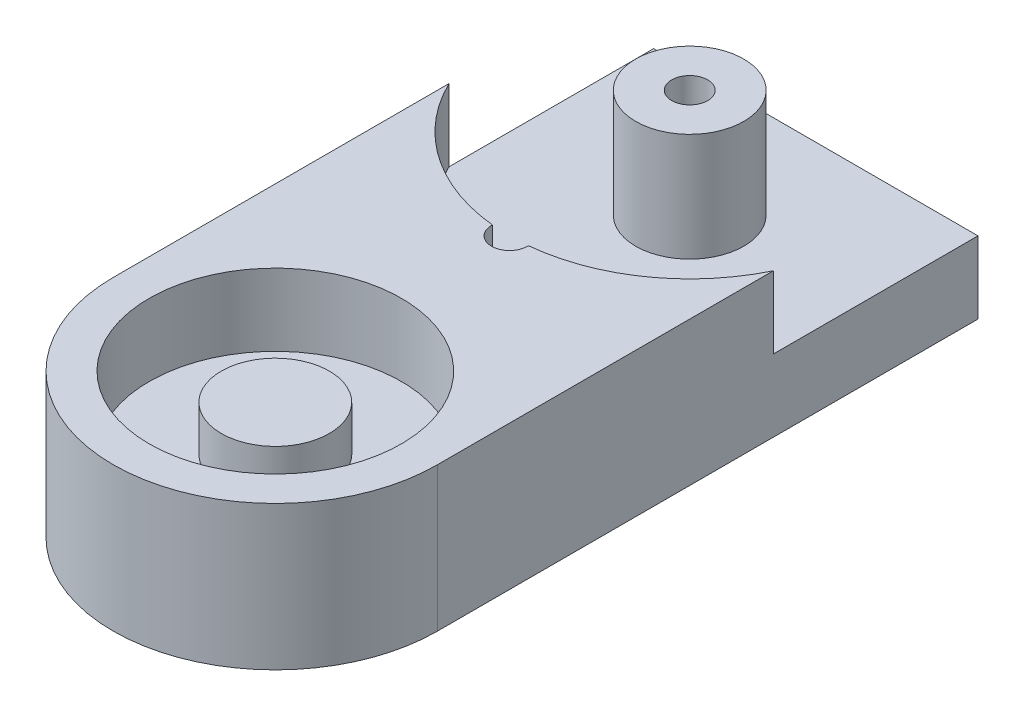
ISO-10303-21;
HEADER;
FILE_DESCRIPTION(('STEP AP214'),'2;1');
FILE_NAME('part.step','',(''),(''),'','','');
FILE_SCHEMA(('AUTOMOTIVE_DESIGN { 1 0 10303 214 1 1 1 1 }'));
ENDSEC;
DATA;
#1=APPLICATION_CONTEXT('core data for automotive mechanical design processes');
#2=APPLICATION_PROTOCOL_DEFINITION('international standard','automotive_design',2000,#1);
#3=PRODUCT_CONTEXT('',#1,'mechanical');
#4=PRODUCT('Part','Part','',(#3));
#5=PRODUCT_RELATED_PRODUCT_CATEGORY('part','',(#4));
#6=PRODUCT_DEFINITION_FORMATION('','',#4);
#7=PRODUCT_DEFINITION_CONTEXT('part definition',#1,'design');
#8=PRODUCT_DEFINITION('design','',#6,#7);
#9=PRODUCT_DEFINITION_SHAPE('','',#8);
#10=(LENGTH_UNIT() NAMED_UNIT(*) SI_UNIT(.MILLI.,.METRE.));
#11=(NAMED_UNIT(*) PLANE_ANGLE_UNIT() SI_UNIT($,.RADIAN.));
#12=(NAMED_UNIT(*) SI_UNIT($,.STERADIAN.) SOLID_ANGLE_UNIT());
#13=UNCERTAINTY_MEASURE_WITH_UNIT(LENGTH_MEASURE(1.E-05),#10,'distance_accuracy_value','');
#14=(GEOMETRIC_REPRESENTATION_CONTEXT(3) GLOBAL_UNCERTAINTY_ASSIGNED_CONTEXT((#13)) GLOBAL_UNIT_ASSIGNED_CONTEXT((#10,
#11,#12)) REPRESENTATION_CONTEXT('',''));
#15=CARTESIAN_POINT('',(0.,0.,0.));
#16=DIRECTION('',(0.,0.,1.));
#17=DIRECTION('',(1.,0.,0.));
#18=AXIS2_PLACEMENT_3D('',#15,#16,#17);
#19=CARTESIAN_POINT('',(6.,4.,-46.504881108845));
#20=DIRECTION('',(0.,1.,0.));
#21=DIRECTION('',(0.,0.,1.));
#22=AXIS2_PLACEMENT_3D('',#19,#20,#21);
#23=PLANE('',#22);
#24=DIRECTION('',(0.,0.,-1.));
#25=VECTOR('',#24,1.);
#26=CARTESIAN_POINT('',(15.,4.,-23.504881108845));
#27=LINE('',#26,#25);
#28=CARTESIAN_POINT('',(15.,4.,-42.1459821653043));
#29=VERTEX_POINT('',#28);
#30=CARTESIAN_POINT('',(15.,4.,-53.504881108845));
#31=VERTEX_POINT('',#30);
#32=EDGE_CURVE('E154',#29,#31,#27,.T.);
#33=ORIENTED_EDGE('',*,*,#32,.T.);
#34=DIRECTION('',(-1.,0.,0.));
#35=VECTOR('',#34,1.);
#36=CARTESIAN_POINT('',(-3.,4.,-53.504881108845));
#37=LINE('',#36,#35);
#38=CARTESIAN_POINT('',(-3.,4.,-53.504881108845));
#39=VERTEX_POINT('',#38);
#40=EDGE_CURVE('E157',#31,#39,#37,.T.);
#41=ORIENTED_EDGE('',*,*,#40,.T.);
#42=DIRECTION('',(0.,0.,1.));
#43=VECTOR('',#42,1.);
#44=CARTESIAN_POINT('',(-3.,4.,-23.504881108845));
#45=LINE('',#44,#43);
#46=CARTESIAN_POINT('',(-3.,4.,-42.1459821653043));
#47=VERTEX_POINT('',#46);
#48=EDGE_CURVE('E166',#39,#47,#45,.T.);
#49=ORIENTED_EDGE('',*,*,#48,.T.);
#50=CARTESIAN_POINT('',(6.,4.,-46.504881108845));
#51=DIRECTION('',(0.,1.,0.));
#52=DIRECTION('',(0.,0.,1.));
#53=AXIS2_PLACEMENT_3D('',#50,#51,#52);
#54=CIRCLE('',#53,10.);
#55=CARTESIAN_POINT('',(5.00125078222807,4.,-36.554881108845));
#56=VERTEX_POINT('',#55);
#57=EDGE_CURVE('E49',#47,#56,#54,.T.);
#58=ORIENTED_EDGE('',*,*,#57,.T.);
#59=CARTESIAN_POINT('',(6.,4.,-36.504881108845));
#60=DIRECTION('',(0.,1.,0.));
#61=DIRECTION('',(0.,0.,1.));
#62=AXIS2_PLACEMENT_3D('',#59,#60,#61);
#63=CIRCLE('',#62,1.);
#64=CARTESIAN_POINT('',(6.99874921777193,4.,-36.554881108845));
#65=VERTEX_POINT('',#64);
#66=EDGE_CURVE('E138',#65,#56,#63,.T.);
#67=ORIENTED_EDGE('',*,*,#66,.F.);
#68=EDGE_CURVE('E158',#65,#29,#54,.T.);
#69=ORIENTED_EDGE('',*,*,#68,.T.);
#70=EDGE_LOOP('',(#33,#41,#49,#58,#67,#69));
#71=FACE_BOUND('',#70,.T.);
#72=CARTESIAN_POINT('',(6.,4.,-46.504881108845));
#73=DIRECTION('',(0.,1.,0.));
#74=DIRECTION('',(0.,0.,1.));
#75=AXIS2_PLACEMENT_3D('',#72,#73,#74);
#76=CIRCLE('',#75,3.);
#77=CARTESIAN_POINT('',(6.,4.,-43.504881108845));
#78=VERTEX_POINT('',#77);
#79=EDGE_CURVE('E197',#78,#78,#76,.T.);
#80=ORIENTED_EDGE('',*,*,#79,.F.);
#81=EDGE_LOOP('',(#80));
#82=FACE_BOUND('',#81,.T.);
#83=ADVANCED_FACE('F33',(#71,#82),#23,.T.);
#84=CARTESIAN_POINT('',(-3.,8.,-53.504881108845));
#85=DIRECTION('',(0.,0.,1.));
#86=DIRECTION('',(1.,0.,0.));
#87=AXIS2_PLACEMENT_3D('',#84,#85,#86);
#88=PLANE('',#87);
#89=CARTESIAN_POINT('',(0.,2.,-53.504881108845));
#90=DIRECTION('',(0.,0.,-1.));
#91=DIRECTION('',(-1.,0.,0.));
#92=AXIS2_PLACEMENT_3D('',#89,#90,#91);
#93=CIRCLE('',#92,1.);
#94=CARTESIAN_POINT('',(-0.999999999999999,2.,-53.504881108845));
#95=VERTEX_POINT('',#94);
#96=EDGE_CURVE('E212',#95,#95,#93,.T.);
#97=ORIENTED_EDGE('',*,*,#96,.F.);
#98=EDGE_LOOP('',(#97));
#99=FACE_BOUND('',#98,.T.);
#100=CARTESIAN_POINT('',(12.,2.,-53.504881108845));
#101=DIRECTION('',(0.,0.,-1.));
#102=DIRECTION('',(-1.,0.,0.));
#103=AXIS2_PLACEMENT_3D('',#100,#101,#102);
#104=CIRCLE('',#103,1.);
#105=CARTESIAN_POINT('',(11.,2.,-53.504881108845));
#106=VERTEX_POINT('',#105);
#107=EDGE_CURVE('E206',#106,#106,#104,.T.);
#108=ORIENTED_EDGE('',*,*,#107,.F.);
#109=EDGE_LOOP('',(#108));
#110=FACE_BOUND('',#109,.T.);
#111=DIRECTION('',(0.,-1.,0.));
#112=VECTOR('',#111,1.);
#113=CARTESIAN_POINT('',(15.,8.,-53.504881108845));
#114=LINE('',#113,#112);
#115=CARTESIAN_POINT('',(15.,0.,-53.504881108845));
#116=VERTEX_POINT('',#115);
#117=EDGE_CURVE('E112',#31,#116,#114,.T.);
#118=ORIENTED_EDGE('',*,*,#117,.T.);
#119=DIRECTION('',(-1.,0.,0.));
#120=VECTOR('',#119,1.);
#121=CARTESIAN_POINT('',(-3.,0.,-53.504881108845));
#122=LINE('',#121,#120);
#123=CARTESIAN_POINT('',(-3.,0.,-53.504881108845));
#124=VERTEX_POINT('',#123);
#125=EDGE_CURVE('E95',#116,#124,#122,.T.);
#126=ORIENTED_EDGE('',*,*,#125,.T.);
#127=DIRECTION('',(0.,-1.,0.));
#128=VECTOR('',#127,1.);
#129=CARTESIAN_POINT('',(-3.,8.,-53.504881108845));
#130=LINE('',#129,#128);
#131=EDGE_CURVE('E85',#39,#124,#130,.T.);
#132=ORIENTED_EDGE('',*,*,#131,.F.);
#133=ORIENTED_EDGE('',*,*,#40,.F.);
#134=EDGE_LOOP('',(#118,#126,#132,#133));
#135=FACE_BOUND('',#134,.T.);
#136=ADVANCED_FACE('F165',(#99,#110,#135),#88,.F.);
#137=CARTESIAN_POINT('',(6.,4.,-23.504881108845));
#138=DIRECTION('',(0.,1.,0.));
#139=DIRECTION('',(0.,0.,1.));
#140=AXIS2_PLACEMENT_3D('',#137,#138,#139);
#141=CYLINDRICAL_SURFACE('',#140,3.);
#142=CARTESIAN_POINT('',(6.,4.,-23.504881108845));
#143=DIRECTION('',(0.,1.,0.));
#144=DIRECTION('',(0.,0.,1.));
#145=AXIS2_PLACEMENT_3D('',#142,#143,#144);
#146=CIRCLE('',#145,3.);
#147=CARTESIAN_POINT('',(6.,4.,-20.504881108845));
#148=VERTEX_POINT('',#147);
#149=EDGE_CURVE('E179',#148,#148,#146,.T.);
#150=ORIENTED_EDGE('',*,*,#149,.T.);
#151=EDGE_LOOP('',(#150));
#152=FACE_BOUND('',#151,.T.);
#153=CARTESIAN_POINT('',(6.,6.5,-23.504881108845));
#154=DIRECTION('',(0.,1.,0.));
#155=DIRECTION('',(0.,0.,1.));
#156=AXIS2_PLACEMENT_3D('',#153,#154,#155);
#157=CIRCLE('',#156,3.);
#158=CARTESIAN_POINT('',(6.,6.5,-20.504881108845));
#159=VERTEX_POINT('',#158);
#160=EDGE_CURVE('E184',#159,#159,#157,.T.);
#161=ORIENTED_EDGE('',*,*,#160,.F.);
#162=EDGE_LOOP('',(#161));
#163=FACE_BOUND('',#162,.T.);
#164=ADVANCED_FACE('F229',(#152,#163),#141,.T.);
#165=CARTESIAN_POINT('',(6.,8.,-23.504881108845));
#166=DIRECTION('',(0.,1.,0.));
#167=DIRECTION('',(0.,0.,1.));
#168=AXIS2_PLACEMENT_3D('',#165,#166,#167);
#169=PLANE('',#168);
#170=CARTESIAN_POINT('',(6.,8.,-46.504881108845));
#171=DIRECTION('',(0.,1.,0.));
#172=DIRECTION('',(0.,0.,1.));
#173=AXIS2_PLACEMENT_3D('',#170,#171,#172);
#174=CIRCLE('',#173,10.);
#175=CARTESIAN_POINT('',(-3.,8.,-42.1459821653043));
#176=VERTEX_POINT('',#175);
#177=CARTESIAN_POINT('',(5.00125078222807,8.,-36.554881108845));
#178=VERTEX_POINT('',#177);
#179=EDGE_CURVE('E194',#176,#178,#174,.T.);
#180=ORIENTED_EDGE('',*,*,#179,.F.);
#181=DIRECTION('',(0.,0.,1.));
#182=VECTOR('',#181,1.);
#183=CARTESIAN_POINT('',(-3.,8.,-23.504881108845));
#184=LINE('',#183,#182);
#185=CARTESIAN_POINT('',(-3.,8.,-23.504881108845));
#186=VERTEX_POINT('',#185);
#187=EDGE_CURVE('E58',#176,#186,#184,.T.);
#188=ORIENTED_EDGE('',*,*,#187,.T.);
#189=CARTESIAN_POINT('',(6.,8.,-23.504881108845));
#190=DIRECTION('',(0.,1.,0.));
#191=DIRECTION('',(0.,0.,1.));
#192=AXIS2_PLACEMENT_3D('',#189,#190,#191);
#193=CIRCLE('',#192,9.);
#194=CARTESIAN_POINT('',(15.,8.,-23.504881108845));
#195=VERTEX_POINT('',#194);
#196=EDGE_CURVE('E83',#186,#195,#193,.T.);
#197=ORIENTED_EDGE('',*,*,#196,.T.);
#198=DIRECTION('',(0.,0.,-1.));
#199=VECTOR('',#198,1.);
#200=CARTESIAN_POINT('',(15.,8.,-23.504881108845));
#201=LINE('',#200,#199);
#202=CARTESIAN_POINT('',(15.,8.,-42.1459821653043));
#203=VERTEX_POINT('',#202);
#204=EDGE_CURVE('E170',#195,#203,#201,.T.);
#205=ORIENTED_EDGE('',*,*,#204,.T.);
#206=CARTESIAN_POINT('',(6.99874921777193,8.,-36.554881108845));
#207=VERTEX_POINT('',#206);
#208=EDGE_CURVE('E192',#207,#203,#174,.T.);
#209=ORIENTED_EDGE('',*,*,#208,.F.);
#210=CARTESIAN_POINT('',(6.,8.,-36.504881108845));
#211=DIRECTION('',(0.,1.,0.));
#212=DIRECTION('',(0.,0.,1.));
#213=AXIS2_PLACEMENT_3D('',#210,#211,#212);
#214=CIRCLE('',#213,1.);
#215=EDGE_CURVE('E101',#178,#207,#214,.T.);
#216=ORIENTED_EDGE('',*,*,#215,.F.);
#217=EDGE_LOOP('',(#180,#188,#197,#205,#209,#216));
#218=FACE_BOUND('',#217,.T.);
#219=CARTESIAN_POINT('',(6.,8.,-23.504881108845));
#220=DIRECTION('',(0.,1.,0.));
#221=DIRECTION('',(0.,0.,1.));
#222=AXIS2_PLACEMENT_3D('',#219,#220,#221);
#223=CIRCLE('',#222,7.);
#224=CARTESIAN_POINT('',(6.,8.,-16.504881108845));
#225=VERTEX_POINT('',#224);
#226=EDGE_CURVE('E176',#225,#225,#223,.T.);
#227=ORIENTED_EDGE('',*,*,#226,.F.);
#228=EDGE_LOOP('',(#227));
#229=FACE_BOUND('',#228,.T.);
#230=ADVANCED_FACE('F172',(#218,#229),#169,.T.);
#231=CARTESIAN_POINT('',(6.,0.,-23.504881108845));
#232=DIRECTION('',(0.,1.,0.));
#233=DIRECTION('',(0.,0.,1.));
#234=AXIS2_PLACEMENT_3D('',#231,#232,#233);
#235=PLANE('',#234);
#236=CARTESIAN_POINT('',(6.,0.,-23.504881108845));
#237=DIRECTION('',(0.,1.,0.));
#238=DIRECTION('',(0.,0.,1.));
#239=AXIS2_PLACEMENT_3D('',#236,#237,#238);
#240=CIRCLE('',#239,9.);
#241=CARTESIAN_POINT('',(-3.,0.,-23.504881108845));
#242=VERTEX_POINT('',#241);
#243=CARTESIAN_POINT('',(15.,0.,-23.504881108845));
#244=VERTEX_POINT('',#243);
#245=EDGE_CURVE('E82',#242,#244,#240,.T.);
#246=ORIENTED_EDGE('',*,*,#245,.F.);
#247=DIRECTION('',(0.,0.,1.));
#248=VECTOR('',#247,1.);
#249=CARTESIAN_POINT('',(-3.,0.,-23.504881108845));
#250=LINE('',#249,#248);
#251=EDGE_CURVE('E88',#124,#242,#250,.T.);
#252=ORIENTED_EDGE('',*,*,#251,.F.);
#253=ORIENTED_EDGE('',*,*,#125,.F.);
#254=DIRECTION('',(0.,0.,-1.));
#255=VECTOR('',#254,1.);
#256=CARTESIAN_POINT('',(15.,0.,-23.504881108845));
#257=LINE('',#256,#255);
#258=EDGE_CURVE('E100',#244,#116,#257,.T.);
#259=ORIENTED_EDGE('',*,*,#258,.F.);
#260=EDGE_LOOP('',(#246,#252,#253,#259));
#261=FACE_BOUND('',#260,.T.);
#262=ADVANCED_FACE('F98',(#261),#235,.F.);
#263=CARTESIAN_POINT('',(6.,8.,-23.504881108845));
#264=DIRECTION('',(0.,-1.,0.));
#265=DIRECTION('',(0.,0.,-1.));
#266=AXIS2_PLACEMENT_3D('',#263,#264,#265);
#267=CYLINDRICAL_SURFACE('',#266,9.);
#268=ORIENTED_EDGE('',*,*,#245,.T.);
#269=DIRECTION('',(0.,-1.,0.));
#270=VECTOR('',#269,1.);
#271=CARTESIAN_POINT('',(15.,8.,-23.504881108845));
#272=LINE('',#271,#270);
#273=EDGE_CURVE('E114',#195,#244,#272,.T.);
#274=ORIENTED_EDGE('',*,*,#273,.F.);
#275=ORIENTED_EDGE('',*,*,#196,.F.);
#276=DIRECTION('',(0.,-1.,0.));
#277=VECTOR('',#276,1.);
#278=CARTESIAN_POINT('',(-3.,8.,-23.504881108845));
#279=LINE('',#278,#277);
#280=EDGE_CURVE('E78',#186,#242,#279,.T.);
#281=ORIENTED_EDGE('',*,*,#280,.T.);
#282=EDGE_LOOP('',(#268,#274,#275,#281));
#283=FACE_BOUND('',#282,.T.);
#284=ADVANCED_FACE('F35',(#283),#267,.T.);
#285=CARTESIAN_POINT('',(15.,8.,-23.504881108845));
#286=DIRECTION('',(-1.,0.,0.));
#287=DIRECTION('',(0.,0.,1.));
#288=AXIS2_PLACEMENT_3D('',#285,#286,#287);
#289=PLANE('',#288);
#290=ORIENTED_EDGE('',*,*,#273,.T.);
#291=ORIENTED_EDGE('',*,*,#258,.T.);
#292=ORIENTED_EDGE('',*,*,#117,.F.);
#293=ORIENTED_EDGE('',*,*,#32,.F.);
#294=DIRECTION('',(0.,1.,0.));
#295=VECTOR('',#294,1.);
#296=CARTESIAN_POINT('',(15.,4.,-42.1459821653043));
#297=LINE('',#296,#295);
#298=EDGE_CURVE('E171',#29,#203,#297,.T.);
#299=ORIENTED_EDGE('',*,*,#298,.T.);
#300=ORIENTED_EDGE('',*,*,#204,.F.);
#301=EDGE_LOOP('',(#290,#291,#292,#293,#299,#300));
#302=FACE_BOUND('',#301,.T.);
#303=ADVANCED_FACE('F168',(#302),#289,.F.);
#304=CARTESIAN_POINT('',(-3.,8.,-23.504881108845));
#305=DIRECTION('',(1.,0.,0.));
#306=DIRECTION('',(0.,0.,-1.));
#307=AXIS2_PLACEMENT_3D('',#304,#305,#306);
#308=PLANE('',#307);
#309=ORIENTED_EDGE('',*,*,#131,.T.);
#310=ORIENTED_EDGE('',*,*,#251,.T.);
#311=ORIENTED_EDGE('',*,*,#280,.F.);
#312=ORIENTED_EDGE('',*,*,#187,.F.);
#313=DIRECTION('',(0.,1.,0.));
#314=VECTOR('',#313,1.);
#315=CARTESIAN_POINT('',(-3.,4.,-42.1459821653043));
#316=LINE('',#315,#314);
#317=EDGE_CURVE('E162',#176,#47,#316,.F.);
#318=ORIENTED_EDGE('',*,*,#317,.T.);
#319=ORIENTED_EDGE('',*,*,#48,.F.);
#320=EDGE_LOOP('',(#309,#310,#311,#312,#318,#319));
#321=FACE_BOUND('',#320,.T.);
#322=ADVANCED_FACE('F89',(#321),#308,.F.);
#323=CARTESIAN_POINT('',(6.,8.,-36.504881108845));
#324=DIRECTION('',(0.,-1.,0.));
#325=DIRECTION('',(0.,0.,-1.));
#326=AXIS2_PLACEMENT_3D('',#323,#324,#325);
#327=CYLINDRICAL_SURFACE('',#326,1.);
#328=CARTESIAN_POINT('',(6.,2.,-36.504881108845));
#329=DIRECTION('',(0.,1.,0.));
#330=DIRECTION('',(0.,0.,1.));
#331=AXIS2_PLACEMENT_3D('',#328,#329,#330);
#332=CIRCLE('',#331,1.);
#333=CARTESIAN_POINT('',(6.,2.,-35.504881108845));
#334=VERTEX_POINT('',#333);
#335=EDGE_CURVE('E37',#334,#334,#332,.T.);
#336=ORIENTED_EDGE('',*,*,#335,.F.);
#337=EDGE_LOOP('',(#336));
#338=FACE_BOUND('',#337,.T.);
#339=DIRECTION('',(0.,1.,0.));
#340=VECTOR('',#339,1.);
#341=CARTESIAN_POINT('',(6.99874921777191,6.,-36.554881108845));
#342=LINE('',#341,#340);
#343=EDGE_CURVE('E117',#65,#207,#342,.T.);
#344=ORIENTED_EDGE('',*,*,#343,.F.);
#345=ORIENTED_EDGE('',*,*,#66,.T.);
#346=DIRECTION('',(0.,1.,0.));
#347=VECTOR('',#346,1.);
#348=CARTESIAN_POINT('',(5.00125078222809,6.,-36.554881108845));
#349=LINE('',#348,#347);
#350=EDGE_CURVE('E116',#178,#56,#349,.F.);
#351=ORIENTED_EDGE('',*,*,#350,.F.);
#352=ORIENTED_EDGE('',*,*,#215,.T.);
#353=EDGE_LOOP('',(#344,#345,#351,#352));
#354=FACE_BOUND('',#353,.T.);
#355=ADVANCED_FACE('F130',(#338,#354),#327,.F.);
#356=CARTESIAN_POINT('',(6.,4.,-23.504881108845));
#357=DIRECTION('',(0.,1.,0.));
#358=DIRECTION('',(0.,0.,1.));
#359=AXIS2_PLACEMENT_3D('',#356,#357,#358);
#360=CYLINDRICAL_SURFACE('',#359,7.);
#361=CARTESIAN_POINT('',(6.,4.,-23.504881108845));
#362=DIRECTION('',(0.,1.,0.));
#363=DIRECTION('',(0.,0.,1.));
#364=AXIS2_PLACEMENT_3D('',#361,#362,#363);
#365=CIRCLE('',#364,7.);
#366=CARTESIAN_POINT('',(6.,4.,-16.504881108845));
#367=VERTEX_POINT('',#366);
#368=EDGE_CURVE('E105',#367,#367,#365,.T.);
#369=ORIENTED_EDGE('',*,*,#368,.F.);
#370=EDGE_LOOP('',(#369));
#371=FACE_BOUND('',#370,.T.);
#372=ORIENTED_EDGE('',*,*,#226,.T.);
#373=EDGE_LOOP('',(#372));
#374=FACE_BOUND('',#373,.T.);
#375=ADVANCED_FACE('F133',(#371,#374),#360,.F.);
#376=CARTESIAN_POINT('',(6.,4.,-23.504881108845));
#377=DIRECTION('',(0.,1.,0.));
#378=DIRECTION('',(0.,0.,1.));
#379=AXIS2_PLACEMENT_3D('',#376,#377,#378);
#380=PLANE('',#379);
#381=ORIENTED_EDGE('',*,*,#149,.F.);
#382=EDGE_LOOP('',(#381));
#383=FACE_BOUND('',#382,.T.);
#384=ORIENTED_EDGE('',*,*,#368,.T.);
#385=EDGE_LOOP('',(#384));
#386=FACE_BOUND('',#385,.T.);
#387=ADVANCED_FACE('F263',(#383,#386),#380,.T.);
#388=CARTESIAN_POINT('',(6.,6.5,-23.504881108845));
#389=DIRECTION('',(0.,1.,0.));
#390=DIRECTION('',(0.,0.,1.));
#391=AXIS2_PLACEMENT_3D('',#388,#389,#390);
#392=PLANE('',#391);
#393=ORIENTED_EDGE('',*,*,#160,.T.);
#394=EDGE_LOOP('',(#393));
#395=FACE_BOUND('',#394,.T.);
#396=ADVANCED_FACE('F260',(#395),#392,.T.);
#397=CARTESIAN_POINT('',(6.,4.,-46.504881108845));
#398=DIRECTION('',(0.,1.,0.));
#399=DIRECTION('',(0.,0.,1.));
#400=AXIS2_PLACEMENT_3D('',#397,#398,#399);
#401=CYLINDRICAL_SURFACE('',#400,10.);
#402=ORIENTED_EDGE('',*,*,#68,.F.);
#403=ORIENTED_EDGE('',*,*,#343,.T.);
#404=ORIENTED_EDGE('',*,*,#208,.T.);
#405=ORIENTED_EDGE('',*,*,#298,.F.);
#406=EDGE_LOOP('',(#402,#403,#404,#405));
#407=FACE_BOUND('',#406,.T.);
#408=ADVANCED_FACE('F256',(#407),#401,.F.);
#409=ORIENTED_EDGE('',*,*,#179,.T.);
#410=ORIENTED_EDGE('',*,*,#350,.T.);
#411=ORIENTED_EDGE('',*,*,#57,.F.);
#412=ORIENTED_EDGE('',*,*,#317,.F.);
#413=EDGE_LOOP('',(#409,#410,#411,#412));
#414=FACE_BOUND('',#413,.T.);
#415=ADVANCED_FACE('F259',(#414),#401,.F.);
#416=CARTESIAN_POINT('',(-3.,2.,-53.504881108845));
#417=DIRECTION('',(0.,1.,0.));
#418=DIRECTION('',(0.,0.,1.));
#419=AXIS2_PLACEMENT_3D('',#416,#417,#418);
#420=PLANE('',#419);
#421=ORIENTED_EDGE('',*,*,#335,.T.);
#422=EDGE_LOOP('',(#421));
#423=FACE_BOUND('',#422,.T.);
#424=ADVANCED_FACE('F128',(#423),#420,.T.);
#425=CARTESIAN_POINT('',(6.,10.,-46.504881108845));
#426=DIRECTION('',(0.,1.,0.));
#427=DIRECTION('',(0.,0.,1.));
#428=AXIS2_PLACEMENT_3D('',#425,#426,#427);
#429=PLANE('',#428);
#430=CARTESIAN_POINT('',(6.,10.,-46.504881108845));
#431=DIRECTION('',(0.,1.,0.));
#432=DIRECTION('',(0.,0.,1.));
#433=AXIS2_PLACEMENT_3D('',#430,#431,#432);
#434=CIRCLE('',#433,3.);
#435=CARTESIAN_POINT('',(6.,10.,-43.504881108845));
#436=VERTEX_POINT('',#435);
#437=EDGE_CURVE('E195',#436,#436,#434,.T.);
#438=ORIENTED_EDGE('',*,*,#437,.T.);
#439=EDGE_LOOP('',(#438));
#440=FACE_BOUND('',#439,.T.);
#441=CARTESIAN_POINT('',(6.,10.,-46.504881108845));
#442=DIRECTION('',(0.,1.,0.));
#443=DIRECTION('',(0.,0.,1.));
#444=AXIS2_PLACEMENT_3D('',#441,#442,#443);
#445=CIRCLE('',#444,1.);
#446=CARTESIAN_POINT('',(6.,10.,-45.504881108845));
#447=VERTEX_POINT('',#446);
#448=EDGE_CURVE('E200',#447,#447,#445,.T.);
#449=ORIENTED_EDGE('',*,*,#448,.F.);
#450=EDGE_LOOP('',(#449));
#451=FACE_BOUND('',#450,.T.);
#452=ADVANCED_FACE('F350',(#440,#451),#429,.T.);
#453=CARTESIAN_POINT('',(6.,10.,-46.504881108845));
#454=DIRECTION('',(0.,-1.,0.));
#455=DIRECTION('',(0.,0.,-1.));
#456=AXIS2_PLACEMENT_3D('',#453,#454,#455);
#457=CYLINDRICAL_SURFACE('',#456,3.);
#458=ORIENTED_EDGE('',*,*,#437,.F.);
#459=EDGE_LOOP('',(#458));
#460=FACE_BOUND('',#459,.T.);
#461=ORIENTED_EDGE('',*,*,#79,.T.);
#462=EDGE_LOOP('',(#461));
#463=FACE_BOUND('',#462,.T.);
#464=ADVANCED_FACE('F345',(#460,#463),#457,.T.);
#465=CARTESIAN_POINT('',(6.,2.,-46.504881108845));
#466=DIRECTION('',(0.,1.,0.));
#467=DIRECTION('',(0.,0.,1.));
#468=AXIS2_PLACEMENT_3D('',#465,#466,#467);
#469=CIRCLE('',#468,1.);
#470=CARTESIAN_POINT('',(6.,2.,-45.504881108845));
#471=VERTEX_POINT('',#470);
#472=EDGE_CURVE('E11',#471,#471,#469,.T.);
#473=ORIENTED_EDGE('',*,*,#472,.T.);
#474=EDGE_LOOP('',(#473));
#475=FACE_BOUND('',#474,.T.);
#476=ADVANCED_FACE('F244',(#475),#420,.T.);
#477=CARTESIAN_POINT('',(6.,8.,-46.504881108845));
#478=DIRECTION('',(0.,-1.,0.));
#479=DIRECTION('',(0.,0.,-1.));
#480=AXIS2_PLACEMENT_3D('',#477,#478,#479);
#481=CYLINDRICAL_SURFACE('',#480,1.);
#482=ORIENTED_EDGE('',*,*,#472,.F.);
#483=EDGE_LOOP('',(#482));
#484=FACE_BOUND('',#483,.T.);
#485=ORIENTED_EDGE('',*,*,#448,.T.);
#486=EDGE_LOOP('',(#485));
#487=FACE_BOUND('',#486,.T.);
#488=ADVANCED_FACE('F235',(#484,#487),#481,.F.);
#489=CARTESIAN_POINT('',(12.,2.,-48.504881108845));
#490=DIRECTION('',(0.,0.,-1.));
#491=DIRECTION('',(-1.,0.,0.));
#492=AXIS2_PLACEMENT_3D('',#489,#490,#491);
#493=CYLINDRICAL_SURFACE('',#492,1.);
#494=CARTESIAN_POINT('',(12.,2.,-48.504881108845));
#495=DIRECTION('',(0.,0.,-1.));
#496=DIRECTION('',(-1.,0.,0.));
#497=AXIS2_PLACEMENT_3D('',#494,#495,#496);
#498=CIRCLE('',#497,1.);
#499=CARTESIAN_POINT('',(11.,2.,-48.504881108845));
#500=VERTEX_POINT('',#499);
#501=EDGE_CURVE('E205',#500,#500,#498,.T.);
#502=ORIENTED_EDGE('',*,*,#501,.F.);
#503=EDGE_LOOP('',(#502));
#504=FACE_BOUND('',#503,.T.);
#505=ORIENTED_EDGE('',*,*,#107,.T.);
#506=EDGE_LOOP('',(#505));
#507=FACE_BOUND('',#506,.T.);
#508=ADVANCED_FACE('F233',(#504,#507),#493,.F.);
#509=CARTESIAN_POINT('',(12.,2.,-48.504881108845));
#510=DIRECTION('',(0.,0.,-1.));
#511=DIRECTION('',(-1.,0.,0.));
#512=AXIS2_PLACEMENT_3D('',#509,#510,#511);
#513=PLANE('',#512);
#514=ORIENTED_EDGE('',*,*,#501,.T.);
#515=EDGE_LOOP('',(#514));
#516=FACE_BOUND('',#515,.T.);
#517=ADVANCED_FACE('F223',(#516),#513,.T.);
#518=CARTESIAN_POINT('',(0.,2.,-48.504881108845));
#519=DIRECTION('',(0.,0.,-1.));
#520=DIRECTION('',(-1.,0.,0.));
#521=AXIS2_PLACEMENT_3D('',#518,#519,#520);
#522=CYLINDRICAL_SURFACE('',#521,1.);
#523=CARTESIAN_POINT('',(0.,2.,-48.504881108845));
#524=DIRECTION('',(0.,0.,-1.));
#525=DIRECTION('',(-1.,0.,0.));
#526=AXIS2_PLACEMENT_3D('',#523,#524,#525);
#527=CIRCLE('',#526,1.);
#528=CARTESIAN_POINT('',(-0.999999999999999,2.,-48.504881108845));
#529=VERTEX_POINT('',#528);
#530=EDGE_CURVE('E209',#529,#529,#527,.T.);
#531=ORIENTED_EDGE('',*,*,#530,.F.);
#532=EDGE_LOOP('',(#531));
#533=FACE_BOUND('',#532,.T.);
#534=ORIENTED_EDGE('',*,*,#96,.T.);
#535=EDGE_LOOP('',(#534));
#536=FACE_BOUND('',#535,.T.);
#537=ADVANCED_FACE('F220',(#533,#536),#522,.F.);
#538=CARTESIAN_POINT('',(0.,2.,-48.504881108845));
#539=DIRECTION('',(0.,0.,-1.));
#540=DIRECTION('',(-1.,0.,0.));
#541=AXIS2_PLACEMENT_3D('',#538,#539,#540);
#542=PLANE('',#541);
#543=ORIENTED_EDGE('',*,*,#530,.T.);
#544=EDGE_LOOP('',(#543));
#545=FACE_BOUND('',#544,.T.);
#546=ADVANCED_FACE('F218',(#545),#542,.T.);
#547=CLOSED_SHELL('',(#83,#136,#164,#230,#262,#284,#303,#322,#355,#375,#387,#396,#408,#415,#424,
#452,#464,#476,#488,#508,#517,#537,#546));
#548=MANIFOLD_SOLID_BREP('B2',#547);
#549=ADVANCED_BREP_SHAPE_REPRESENTATION('',(#18,#548),#14);
#550=SHAPE_DEFINITION_REPRESENTATION(#9,#549);
ENDSEC;
END-ISO-10303-21;
